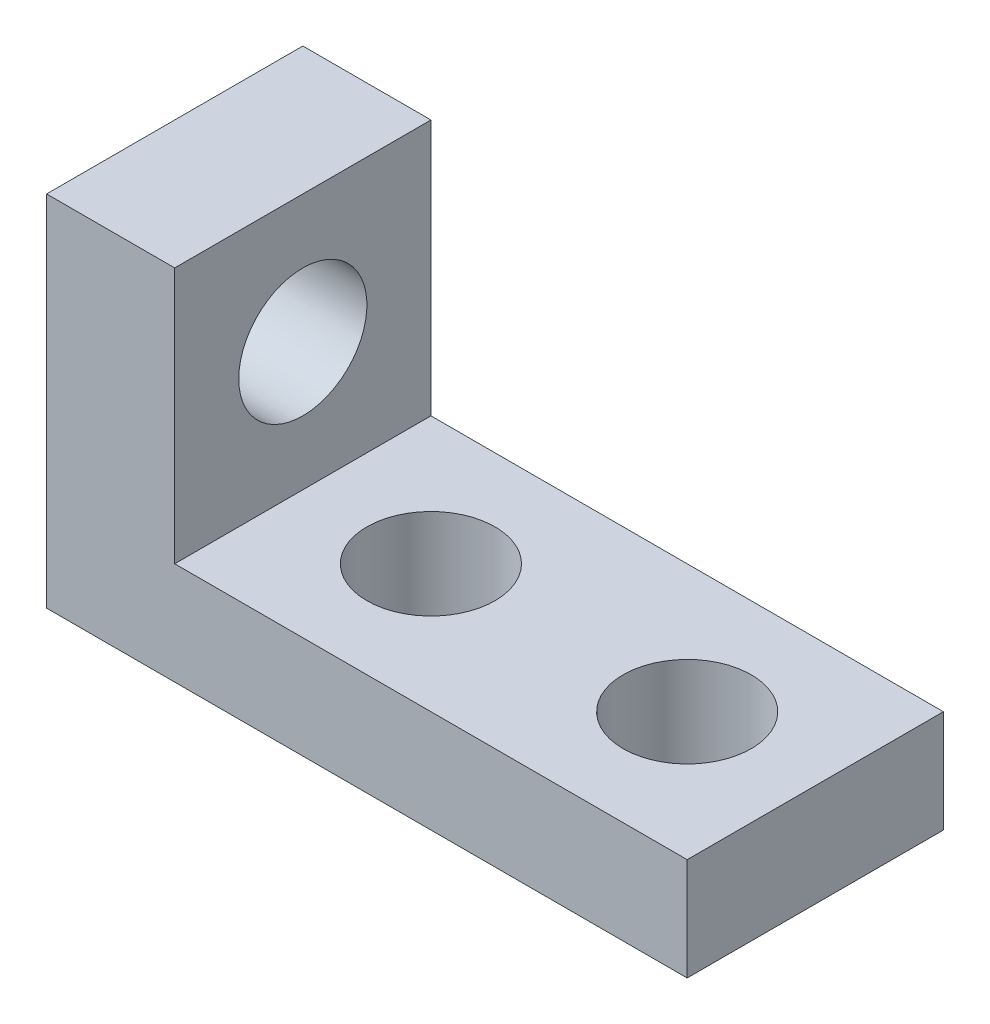
ISO-10303-21;
HEADER;
FILE_DESCRIPTION(('STEP AP214'),'2;1');
FILE_NAME('part.step','',(''),(''),'','','');
FILE_SCHEMA(('AUTOMOTIVE_DESIGN { 1 0 10303 214 1 1 1 1 }'));
ENDSEC;
DATA;
#1=APPLICATION_CONTEXT('core data for automotive mechanical design processes');
#2=APPLICATION_PROTOCOL_DEFINITION('international standard','automotive_design',2000,#1);
#3=PRODUCT_CONTEXT('',#1,'mechanical');
#4=PRODUCT('Part','Part','',(#3));
#5=PRODUCT_RELATED_PRODUCT_CATEGORY('part','',(#4));
#6=PRODUCT_DEFINITION_FORMATION('','',#4);
#7=PRODUCT_DEFINITION_CONTEXT('part definition',#1,'design');
#8=PRODUCT_DEFINITION('design','',#6,#7);
#9=PRODUCT_DEFINITION_SHAPE('','',#8);
#10=(LENGTH_UNIT() NAMED_UNIT(*) SI_UNIT(.MILLI.,.METRE.));
#11=(NAMED_UNIT(*) PLANE_ANGLE_UNIT() SI_UNIT($,.RADIAN.));
#12=(NAMED_UNIT(*) SI_UNIT($,.STERADIAN.) SOLID_ANGLE_UNIT());
#13=UNCERTAINTY_MEASURE_WITH_UNIT(LENGTH_MEASURE(1.E-05),#10,'distance_accuracy_value','');
#14=(GEOMETRIC_REPRESENTATION_CONTEXT(3) GLOBAL_UNCERTAINTY_ASSIGNED_CONTEXT((#13)) GLOBAL_UNIT_ASSIGNED_CONTEXT((#10,
#11,#12)) REPRESENTATION_CONTEXT('',''));
#15=CARTESIAN_POINT('',(0.,0.,0.));
#16=DIRECTION('',(0.,0.,1.));
#17=DIRECTION('',(1.,0.,0.));
#18=AXIS2_PLACEMENT_3D('',#15,#16,#17);
#19=CARTESIAN_POINT('',(0.,2.54,0.));
#20=DIRECTION('',(0.,1.,0.));
#21=DIRECTION('',(0.,0.,1.));
#22=AXIS2_PLACEMENT_3D('',#19,#20,#21);
#23=PLANE('',#22);
#24=CARTESIAN_POINT('',(-3.175,2.54,-3.175));
#25=DIRECTION('',(0.,1.,0.));
#26=DIRECTION('',(0.,0.,1.));
#27=AXIS2_PLACEMENT_3D('',#24,#25,#26);
#28=CIRCLE('',#27,1.5875);
#29=CARTESIAN_POINT('',(-3.175,2.54,-1.5875));
#30=VERTEX_POINT('',#29);
#31=EDGE_CURVE('E107',#30,#30,#28,.T.);
#32=ORIENTED_EDGE('',*,*,#31,.F.);
#33=EDGE_LOOP('',(#32));
#34=FACE_BOUND('',#33,.T.);
#35=DIRECTION('',(0.,0.,-1.));
#36=VECTOR('',#35,1.);
#37=CARTESIAN_POINT('',(0.,2.54,0.));
#38=LINE('',#37,#36);
#39=CARTESIAN_POINT('',(0.,2.54,0.));
#40=VERTEX_POINT('',#39);
#41=CARTESIAN_POINT('',(0.,2.54,-6.35));
#42=VERTEX_POINT('',#41);
#43=EDGE_CURVE('E95',#40,#42,#38,.T.);
#44=ORIENTED_EDGE('',*,*,#43,.T.);
#45=DIRECTION('',(-1.,0.,0.));
#46=VECTOR('',#45,1.);
#47=CARTESIAN_POINT('',(0.,2.54,-6.35));
#48=LINE('',#47,#46);
#49=CARTESIAN_POINT('',(-12.7,2.54,-6.35));
#50=VERTEX_POINT('',#49);
#51=EDGE_CURVE('E88',#42,#50,#48,.T.);
#52=ORIENTED_EDGE('',*,*,#51,.T.);
#53=DIRECTION('',(0.,0.,1.));
#54=VECTOR('',#53,1.);
#55=CARTESIAN_POINT('',(-12.7,2.54,0.));
#56=LINE('',#55,#54);
#57=CARTESIAN_POINT('',(-12.7,2.54,0.));
#58=VERTEX_POINT('',#57);
#59=EDGE_CURVE('E77',#50,#58,#56,.T.);
#60=ORIENTED_EDGE('',*,*,#59,.T.);
#61=DIRECTION('',(1.,0.,0.));
#62=VECTOR('',#61,1.);
#63=CARTESIAN_POINT('',(0.,2.54,0.));
#64=LINE('',#63,#62);
#65=EDGE_CURVE('E57',#58,#40,#64,.T.);
#66=ORIENTED_EDGE('',*,*,#65,.T.);
#67=EDGE_LOOP('',(#44,#52,#60,#66));
#68=FACE_BOUND('',#67,.T.);
#69=CARTESIAN_POINT('',(-9.525,2.54,-3.175));
#70=DIRECTION('',(0.,1.,0.));
#71=DIRECTION('',(0.,0.,1.));
#72=AXIS2_PLACEMENT_3D('',#69,#70,#71);
#73=CIRCLE('',#72,1.5875);
#74=CARTESIAN_POINT('',(-9.525,2.54,-1.5875));
#75=VERTEX_POINT('',#74);
#76=EDGE_CURVE('E125',#75,#75,#73,.T.);
#77=ORIENTED_EDGE('',*,*,#76,.F.);
#78=EDGE_LOOP('',(#77));
#79=FACE_BOUND('',#78,.T.);
#80=ADVANCED_FACE('F39',(#34,#68,#79),#23,.T.);
#81=CARTESIAN_POINT('',(0.,0.,0.));
#82=DIRECTION('',(0.,1.,0.));
#83=DIRECTION('',(0.,0.,1.));
#84=AXIS2_PLACEMENT_3D('',#81,#82,#83);
#85=PLANE('',#84);
#86=DIRECTION('',(0.,0.,-1.));
#87=VECTOR('',#86,1.);
#88=CARTESIAN_POINT('',(0.,0.,0.));
#89=LINE('',#88,#87);
#90=CARTESIAN_POINT('',(0.,0.,0.));
#91=VERTEX_POINT('',#90);
#92=CARTESIAN_POINT('',(0.,0.,-6.35));
#93=VERTEX_POINT('',#92);
#94=EDGE_CURVE('E104',#91,#93,#89,.T.);
#95=ORIENTED_EDGE('',*,*,#94,.F.);
#96=DIRECTION('',(1.,0.,0.));
#97=VECTOR('',#96,1.);
#98=CARTESIAN_POINT('',(0.,0.,0.));
#99=LINE('',#98,#97);
#100=CARTESIAN_POINT('',(-15.875,0.,0.));
#101=VERTEX_POINT('',#100);
#102=EDGE_CURVE('E102',#101,#91,#99,.T.);
#103=ORIENTED_EDGE('',*,*,#102,.F.);
#104=DIRECTION('',(0.,0.,1.));
#105=VECTOR('',#104,1.);
#106=CARTESIAN_POINT('',(-15.875,0.,-6.35));
#107=LINE('',#106,#105);
#108=CARTESIAN_POINT('',(-15.875,0.,-6.35));
#109=VERTEX_POINT('',#108);
#110=EDGE_CURVE('E160',#109,#101,#107,.T.);
#111=ORIENTED_EDGE('',*,*,#110,.F.);
#112=DIRECTION('',(-1.,0.,0.));
#113=VECTOR('',#112,1.);
#114=CARTESIAN_POINT('',(0.,0.,-6.35));
#115=LINE('',#114,#113);
#116=EDGE_CURVE('E70',#93,#109,#115,.T.);
#117=ORIENTED_EDGE('',*,*,#116,.F.);
#118=EDGE_LOOP('',(#95,#103,#111,#117));
#119=FACE_BOUND('',#118,.T.);
#120=CARTESIAN_POINT('',(-3.175,0.,-3.175));
#121=DIRECTION('',(0.,1.,0.));
#122=DIRECTION('',(0.,0.,1.));
#123=AXIS2_PLACEMENT_3D('',#120,#121,#122);
#124=CIRCLE('',#123,1.5875);
#125=CARTESIAN_POINT('',(-3.175,0.,-1.5875));
#126=VERTEX_POINT('',#125);
#127=EDGE_CURVE('E113',#126,#126,#124,.T.);
#128=ORIENTED_EDGE('',*,*,#127,.T.);
#129=EDGE_LOOP('',(#128));
#130=FACE_BOUND('',#129,.T.);
#131=CARTESIAN_POINT('',(-9.525,0.,-3.175));
#132=DIRECTION('',(0.,1.,0.));
#133=DIRECTION('',(0.,0.,1.));
#134=AXIS2_PLACEMENT_3D('',#131,#132,#133);
#135=CIRCLE('',#134,1.5875);
#136=CARTESIAN_POINT('',(-9.525,0.,-1.5875));
#137=VERTEX_POINT('',#136);
#138=EDGE_CURVE('E127',#137,#137,#135,.T.);
#139=ORIENTED_EDGE('',*,*,#138,.T.);
#140=EDGE_LOOP('',(#139));
#141=FACE_BOUND('',#140,.T.);
#142=ADVANCED_FACE('F195',(#119,#130,#141),#85,.F.);
#143=CARTESIAN_POINT('',(0.,2.54,0.));
#144=DIRECTION('',(-1.,0.,0.));
#145=DIRECTION('',(0.,0.,1.));
#146=AXIS2_PLACEMENT_3D('',#143,#144,#145);
#147=PLANE('',#146);
#148=ORIENTED_EDGE('',*,*,#94,.T.);
#149=DIRECTION('',(0.,-1.,0.));
#150=VECTOR('',#149,1.);
#151=CARTESIAN_POINT('',(0.,2.54,-6.35));
#152=LINE('',#151,#150);
#153=EDGE_CURVE('E11',#42,#93,#152,.T.);
#154=ORIENTED_EDGE('',*,*,#153,.F.);
#155=ORIENTED_EDGE('',*,*,#43,.F.);
#156=DIRECTION('',(0.,-1.,0.));
#157=VECTOR('',#156,1.);
#158=CARTESIAN_POINT('',(0.,2.54,0.));
#159=LINE('',#158,#157);
#160=EDGE_CURVE('E49',#40,#91,#159,.T.);
#161=ORIENTED_EDGE('',*,*,#160,.T.);
#162=EDGE_LOOP('',(#148,#154,#155,#161));
#163=FACE_BOUND('',#162,.T.);
#164=ADVANCED_FACE('F41',(#163),#147,.F.);
#165=CARTESIAN_POINT('',(0.,2.54,-6.35));
#166=DIRECTION('',(0.,0.,1.));
#167=DIRECTION('',(1.,0.,0.));
#168=AXIS2_PLACEMENT_3D('',#165,#166,#167);
#169=PLANE('',#168);
#170=ORIENTED_EDGE('',*,*,#116,.T.);
#171=DIRECTION('',(0.,-1.,0.));
#172=VECTOR('',#171,1.);
#173=CARTESIAN_POINT('',(-15.875,0.,-6.35));
#174=LINE('',#173,#172);
#175=CARTESIAN_POINT('',(-15.875,8.89,-6.35));
#176=VERTEX_POINT('',#175);
#177=EDGE_CURVE('E146',#176,#109,#174,.T.);
#178=ORIENTED_EDGE('',*,*,#177,.F.);
#179=DIRECTION('',(1.,0.,0.));
#180=VECTOR('',#179,1.);
#181=CARTESIAN_POINT('',(-15.875,8.89,-6.35));
#182=LINE('',#181,#180);
#183=CARTESIAN_POINT('',(-12.7,8.89,-6.35));
#184=VERTEX_POINT('',#183);
#185=EDGE_CURVE('E138',#176,#184,#182,.T.);
#186=ORIENTED_EDGE('',*,*,#185,.T.);
#187=DIRECTION('',(0.,-1.,0.));
#188=VECTOR('',#187,1.);
#189=CARTESIAN_POINT('',(-12.7,0.,-6.35));
#190=LINE('',#189,#188);
#191=EDGE_CURVE('E93',#184,#50,#190,.T.);
#192=ORIENTED_EDGE('',*,*,#191,.T.);
#193=ORIENTED_EDGE('',*,*,#51,.F.);
#194=ORIENTED_EDGE('',*,*,#153,.T.);
#195=EDGE_LOOP('',(#170,#178,#186,#192,#193,#194));
#196=FACE_BOUND('',#195,.T.);
#197=ADVANCED_FACE('F89',(#196),#169,.F.);
#198=CARTESIAN_POINT('',(0.,2.54,0.));
#199=DIRECTION('',(0.,0.,-1.));
#200=DIRECTION('',(-1.,0.,0.));
#201=AXIS2_PLACEMENT_3D('',#198,#199,#200);
#202=PLANE('',#201);
#203=ORIENTED_EDGE('',*,*,#102,.T.);
#204=ORIENTED_EDGE('',*,*,#160,.F.);
#205=ORIENTED_EDGE('',*,*,#65,.F.);
#206=DIRECTION('',(0.,1.,0.));
#207=VECTOR('',#206,1.);
#208=CARTESIAN_POINT('',(-12.7,0.,0.));
#209=LINE('',#208,#207);
#210=CARTESIAN_POINT('',(-12.7,8.89,0.));
#211=VERTEX_POINT('',#210);
#212=EDGE_CURVE('E147',#58,#211,#209,.T.);
#213=ORIENTED_EDGE('',*,*,#212,.T.);
#214=DIRECTION('',(1.,0.,0.));
#215=VECTOR('',#214,1.);
#216=CARTESIAN_POINT('',(-15.875,8.89,0.));
#217=LINE('',#216,#215);
#218=CARTESIAN_POINT('',(-15.875,8.89,0.));
#219=VERTEX_POINT('',#218);
#220=EDGE_CURVE('E131',#219,#211,#217,.T.);
#221=ORIENTED_EDGE('',*,*,#220,.F.);
#222=DIRECTION('',(0.,1.,0.));
#223=VECTOR('',#222,1.);
#224=CARTESIAN_POINT('',(-15.875,0.,0.));
#225=LINE('',#224,#223);
#226=EDGE_CURVE('E156',#101,#219,#225,.T.);
#227=ORIENTED_EDGE('',*,*,#226,.F.);
#228=EDGE_LOOP('',(#203,#204,#205,#213,#221,#227));
#229=FACE_BOUND('',#228,.T.);
#230=ADVANCED_FACE('F207',(#229),#202,.F.);
#231=CARTESIAN_POINT('',(-3.175,2.54,-3.175));
#232=DIRECTION('',(0.,-1.,0.));
#233=DIRECTION('',(0.,0.,-1.));
#234=AXIS2_PLACEMENT_3D('',#231,#232,#233);
#235=CYLINDRICAL_SURFACE('',#234,1.5875);
#236=ORIENTED_EDGE('',*,*,#31,.T.);
#237=EDGE_LOOP('',(#236));
#238=FACE_BOUND('',#237,.T.);
#239=ORIENTED_EDGE('',*,*,#127,.F.);
#240=EDGE_LOOP('',(#239));
#241=FACE_BOUND('',#240,.T.);
#242=ADVANCED_FACE('F204',(#238,#241),#235,.F.);
#243=CARTESIAN_POINT('',(-9.525,2.54,-3.175));
#244=DIRECTION('',(0.,-1.,0.));
#245=DIRECTION('',(0.,0.,-1.));
#246=AXIS2_PLACEMENT_3D('',#243,#244,#245);
#247=CYLINDRICAL_SURFACE('',#246,1.5875);
#248=ORIENTED_EDGE('',*,*,#76,.T.);
#249=EDGE_LOOP('',(#248));
#250=FACE_BOUND('',#249,.T.);
#251=ORIENTED_EDGE('',*,*,#138,.F.);
#252=EDGE_LOOP('',(#251));
#253=FACE_BOUND('',#252,.T.);
#254=ADVANCED_FACE('F190',(#250,#253),#247,.F.);
#255=CARTESIAN_POINT('',(-12.7,0.,0.));
#256=DIRECTION('',(1.,0.,0.));
#257=DIRECTION('',(0.,0.,-1.));
#258=AXIS2_PLACEMENT_3D('',#255,#256,#257);
#259=PLANE('',#258);
#260=CARTESIAN_POINT('',(-12.7,5.715,-3.175));
#261=DIRECTION('',(-1.,0.,0.));
#262=DIRECTION('',(0.,0.,1.));
#263=AXIS2_PLACEMENT_3D('',#260,#261,#262);
#264=CIRCLE('',#263,1.5875);
#265=CARTESIAN_POINT('',(-12.7,5.715,-1.5875));
#266=VERTEX_POINT('',#265);
#267=EDGE_CURVE('E167',#266,#266,#264,.T.);
#268=ORIENTED_EDGE('',*,*,#267,.T.);
#269=EDGE_LOOP('',(#268));
#270=FACE_BOUND('',#269,.T.);
#271=ORIENTED_EDGE('',*,*,#59,.F.);
#272=ORIENTED_EDGE('',*,*,#191,.F.);
#273=DIRECTION('',(0.,0.,-1.));
#274=VECTOR('',#273,1.);
#275=CARTESIAN_POINT('',(-12.7,8.89,-6.35));
#276=LINE('',#275,#274);
#277=EDGE_CURVE('E142',#211,#184,#276,.T.);
#278=ORIENTED_EDGE('',*,*,#277,.F.);
#279=ORIENTED_EDGE('',*,*,#212,.F.);
#280=EDGE_LOOP('',(#271,#272,#278,#279));
#281=FACE_BOUND('',#280,.T.);
#282=ADVANCED_FACE('F181',(#270,#281),#259,.T.);
#283=CARTESIAN_POINT('',(-15.875,0.,0.));
#284=DIRECTION('',(1.,0.,0.));
#285=DIRECTION('',(0.,0.,-1.));
#286=AXIS2_PLACEMENT_3D('',#283,#284,#285);
#287=PLANE('',#286);
#288=ORIENTED_EDGE('',*,*,#177,.T.);
#289=ORIENTED_EDGE('',*,*,#110,.T.);
#290=ORIENTED_EDGE('',*,*,#226,.T.);
#291=DIRECTION('',(0.,0.,-1.));
#292=VECTOR('',#291,1.);
#293=CARTESIAN_POINT('',(-15.875,8.89,-6.35));
#294=LINE('',#293,#292);
#295=EDGE_CURVE('E141',#219,#176,#294,.T.);
#296=ORIENTED_EDGE('',*,*,#295,.T.);
#297=EDGE_LOOP('',(#288,#289,#290,#296));
#298=FACE_BOUND('',#297,.T.);
#299=CARTESIAN_POINT('',(-15.875,5.715,-3.175));
#300=DIRECTION('',(-1.,0.,0.));
#301=DIRECTION('',(0.,0.,1.));
#302=AXIS2_PLACEMENT_3D('',#299,#300,#301);
#303=CIRCLE('',#302,1.5875);
#304=CARTESIAN_POINT('',(-15.875,5.715,-1.5875));
#305=VERTEX_POINT('',#304);
#306=EDGE_CURVE('E153',#305,#305,#303,.T.);
#307=ORIENTED_EDGE('',*,*,#306,.F.);
#308=EDGE_LOOP('',(#307));
#309=FACE_BOUND('',#308,.T.);
#310=ADVANCED_FACE('F178',(#298,#309),#287,.F.);
#311=CARTESIAN_POINT('',(-15.875,8.89,-6.35));
#312=DIRECTION('',(0.,-1.,0.));
#313=DIRECTION('',(0.,0.,-1.));
#314=AXIS2_PLACEMENT_3D('',#311,#312,#313);
#315=PLANE('',#314);
#316=ORIENTED_EDGE('',*,*,#277,.T.);
#317=ORIENTED_EDGE('',*,*,#185,.F.);
#318=ORIENTED_EDGE('',*,*,#295,.F.);
#319=ORIENTED_EDGE('',*,*,#220,.T.);
#320=EDGE_LOOP('',(#316,#317,#318,#319));
#321=FACE_BOUND('',#320,.T.);
#322=ADVANCED_FACE('F180',(#321),#315,.F.);
#323=CARTESIAN_POINT('',(-15.875,5.715,-3.175));
#324=DIRECTION('',(1.,0.,0.));
#325=DIRECTION('',(0.,0.,-1.));
#326=AXIS2_PLACEMENT_3D('',#323,#324,#325);
#327=CYLINDRICAL_SURFACE('',#326,1.5875);
#328=ORIENTED_EDGE('',*,*,#306,.T.);
#329=EDGE_LOOP('',(#328));
#330=FACE_BOUND('',#329,.T.);
#331=ORIENTED_EDGE('',*,*,#267,.F.);
#332=EDGE_LOOP('',(#331));
#333=FACE_BOUND('',#332,.T.);
#334=ADVANCED_FACE('F175',(#330,#333),#327,.F.);
#335=CLOSED_SHELL('',(#80,#142,#164,#197,#230,#242,#254,#282,#310,#322,#334));
#336=MANIFOLD_SOLID_BREP('B2',#335);
#337=ADVANCED_BREP_SHAPE_REPRESENTATION('',(#18,#336),#14);
#338=SHAPE_DEFINITION_REPRESENTATION(#9,#337);
ENDSEC;
END-ISO-10303-21;
